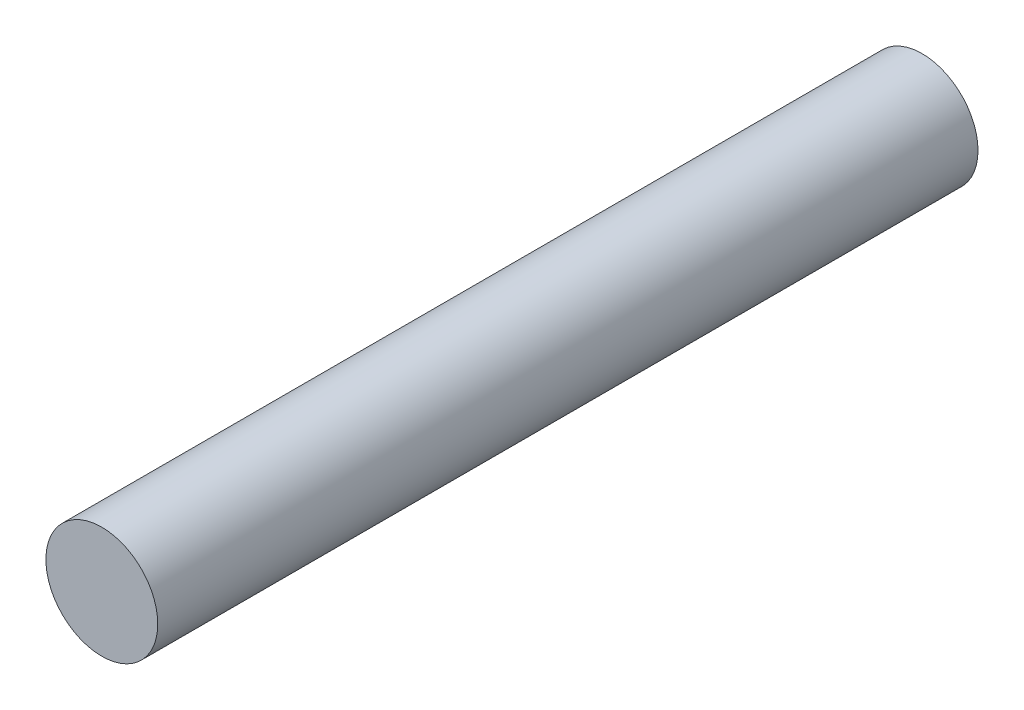
ISO-10303-21;
HEADER;
FILE_DESCRIPTION(('STEP AP214'),'2;1');
FILE_NAME('part.step','',(''),(''),'','','');
FILE_SCHEMA(('AUTOMOTIVE_DESIGN { 1 0 10303 214 1 1 1 1 }'));
ENDSEC;
DATA;
#1=APPLICATION_CONTEXT('core data for automotive mechanical design processes');
#2=APPLICATION_PROTOCOL_DEFINITION('international standard','automotive_design',2000,#1);
#3=PRODUCT_CONTEXT('',#1,'mechanical');
#4=PRODUCT('Part','Part','',(#3));
#5=PRODUCT_RELATED_PRODUCT_CATEGORY('part','',(#4));
#6=PRODUCT_DEFINITION_FORMATION('','',#4);
#7=PRODUCT_DEFINITION_CONTEXT('part definition',#1,'design');
#8=PRODUCT_DEFINITION('design','',#6,#7);
#9=PRODUCT_DEFINITION_SHAPE('','',#8);
#10=(LENGTH_UNIT() NAMED_UNIT(*) SI_UNIT(.MILLI.,.METRE.));
#11=(NAMED_UNIT(*) PLANE_ANGLE_UNIT() SI_UNIT($,.RADIAN.));
#12=(NAMED_UNIT(*) SI_UNIT($,.STERADIAN.) SOLID_ANGLE_UNIT());
#13=UNCERTAINTY_MEASURE_WITH_UNIT(LENGTH_MEASURE(1.E-05),#10,'distance_accuracy_value','');
#14=(GEOMETRIC_REPRESENTATION_CONTEXT(3) GLOBAL_UNCERTAINTY_ASSIGNED_CONTEXT((#13)) GLOBAL_UNIT_ASSIGNED_CONTEXT((#10,
#11,#12)) REPRESENTATION_CONTEXT('',''));
#15=CARTESIAN_POINT('',(0.,0.,0.));
#16=DIRECTION('',(0.,0.,1.));
#17=DIRECTION('',(1.,0.,0.));
#18=AXIS2_PLACEMENT_3D('',#15,#16,#17);
#19=CARTESIAN_POINT('',(0.,0.,27.5));
#20=DIRECTION('',(0.,0.,-1.));
#21=DIRECTION('',(-1.,0.,0.));
#22=AXIS2_PLACEMENT_3D('',#19,#20,#21);
#23=CYLINDRICAL_SURFACE('',#22,3.75);
#24=CARTESIAN_POINT('',(0.,0.,27.5));
#25=DIRECTION('',(0.,0.,1.));
#26=DIRECTION('',(1.,0.,0.));
#27=AXIS2_PLACEMENT_3D('',#24,#25,#26);
#28=CIRCLE('',#27,3.75);
#29=CARTESIAN_POINT('',(3.75,0.,27.5));
#30=VERTEX_POINT('',#29);
#31=EDGE_CURVE('E10',#30,#30,#28,.T.);
#32=ORIENTED_EDGE('',*,*,#31,.F.);
#33=EDGE_LOOP('',(#32));
#34=FACE_BOUND('',#33,.T.);
#35=CARTESIAN_POINT('',(0.,0.,-27.5));
#36=DIRECTION('',(0.,0.,1.));
#37=DIRECTION('',(1.,0.,0.));
#38=AXIS2_PLACEMENT_3D('',#35,#36,#37);
#39=CIRCLE('',#38,3.75);
#40=CARTESIAN_POINT('',(3.75,0.,-27.5));
#41=VERTEX_POINT('',#40);
#42=EDGE_CURVE('E35',#41,#41,#39,.T.);
#43=ORIENTED_EDGE('',*,*,#42,.T.);
#44=EDGE_LOOP('',(#43));
#45=FACE_BOUND('',#44,.T.);
#46=ADVANCED_FACE('F32',(#34,#45),#23,.T.);
#47=CARTESIAN_POINT('',(0.,0.,27.5));
#48=DIRECTION('',(0.,0.,1.));
#49=DIRECTION('',(1.,0.,0.));
#50=AXIS2_PLACEMENT_3D('',#47,#48,#49);
#51=PLANE('',#50);
#52=ORIENTED_EDGE('',*,*,#31,.T.);
#53=EDGE_LOOP('',(#52));
#54=FACE_BOUND('',#53,.T.);
#55=ADVANCED_FACE('F47',(#54),#51,.T.);
#56=CARTESIAN_POINT('',(0.,0.,-27.5));
#57=DIRECTION('',(0.,0.,1.));
#58=DIRECTION('',(1.,0.,0.));
#59=AXIS2_PLACEMENT_3D('',#56,#57,#58);
#60=PLANE('',#59);
#61=ORIENTED_EDGE('',*,*,#42,.F.);
#62=EDGE_LOOP('',(#61));
#63=FACE_BOUND('',#62,.T.);
#64=ADVANCED_FACE('F45',(#63),#60,.F.);
#65=CLOSED_SHELL('',(#46,#55,#64));
#66=MANIFOLD_SOLID_BREP('B2',#65);
#67=ADVANCED_BREP_SHAPE_REPRESENTATION('',(#18,#66),#14);
#68=SHAPE_DEFINITION_REPRESENTATION(#9,#67);
ENDSEC;
END-ISO-10303-21;
